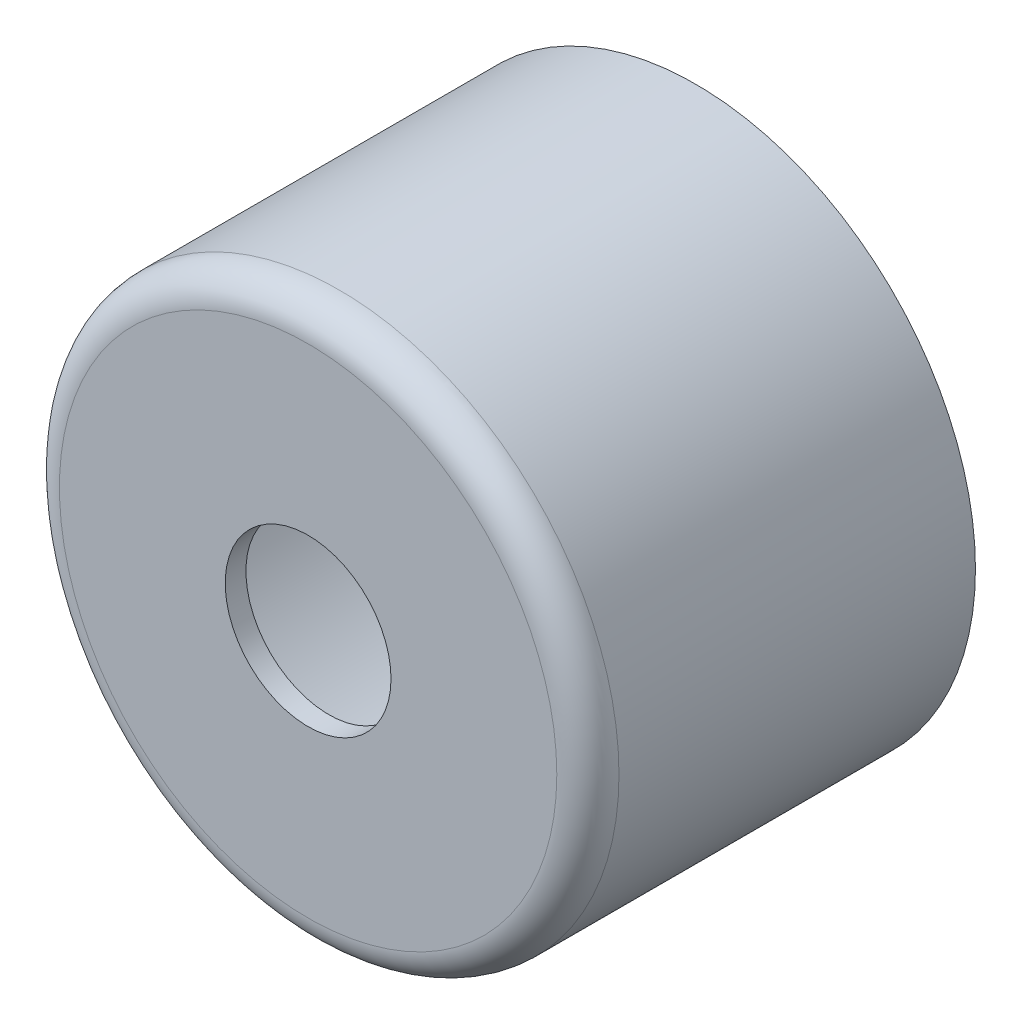
ISO-10303-21;
HEADER;
FILE_DESCRIPTION(('STEP AP214'),'2;1');
FILE_NAME('part.step','',(''),(''),'','','');
FILE_SCHEMA(('AUTOMOTIVE_DESIGN { 1 0 10303 214 1 1 1 1 }'));
ENDSEC;
DATA;
#1=APPLICATION_CONTEXT('core data for automotive mechanical design processes');
#2=APPLICATION_PROTOCOL_DEFINITION('international standard','automotive_design',2000,#1);
#3=PRODUCT_CONTEXT('',#1,'mechanical');
#4=PRODUCT('Part','Part','',(#3));
#5=PRODUCT_RELATED_PRODUCT_CATEGORY('part','',(#4));
#6=PRODUCT_DEFINITION_FORMATION('','',#4);
#7=PRODUCT_DEFINITION_CONTEXT('part definition',#1,'design');
#8=PRODUCT_DEFINITION('design','',#6,#7);
#9=PRODUCT_DEFINITION_SHAPE('','',#8);
#10=(LENGTH_UNIT() NAMED_UNIT(*) SI_UNIT(.MILLI.,.METRE.));
#11=(NAMED_UNIT(*) PLANE_ANGLE_UNIT() SI_UNIT($,.RADIAN.));
#12=(NAMED_UNIT(*) SI_UNIT($,.STERADIAN.) SOLID_ANGLE_UNIT());
#13=UNCERTAINTY_MEASURE_WITH_UNIT(LENGTH_MEASURE(1.E-05),#10,'distance_accuracy_value','');
#14=(GEOMETRIC_REPRESENTATION_CONTEXT(3) GLOBAL_UNCERTAINTY_ASSIGNED_CONTEXT((#13)) GLOBAL_UNIT_ASSIGNED_CONTEXT((#10,
#11,#12)) REPRESENTATION_CONTEXT('',''));
#15=CARTESIAN_POINT('',(0.,0.,0.));
#16=DIRECTION('',(0.,0.,1.));
#17=DIRECTION('',(1.,0.,0.));
#18=AXIS2_PLACEMENT_3D('',#15,#16,#17);
#19=CARTESIAN_POINT('',(0.,0.,18.7));
#20=DIRECTION('',(0.,0.,-1.));
#21=DIRECTION('',(-1.,0.,0.));
#22=AXIS2_PLACEMENT_3D('',#19,#20,#21);
#23=CYLINDRICAL_SURFACE('',#22,13.5);
#24=CARTESIAN_POINT('',(0.,0.,17.2));
#25=DIRECTION('',(0.,0.,1.));
#26=DIRECTION('',(1.,0.,0.));
#27=AXIS2_PLACEMENT_3D('',#24,#25,#26);
#28=CIRCLE('',#27,13.5);
#29=CARTESIAN_POINT('',(13.5,0.,17.2));
#30=VERTEX_POINT('',#29);
#31=EDGE_CURVE('E10',#30,#30,#28,.F.);
#32=ORIENTED_EDGE('',*,*,#31,.T.);
#33=EDGE_LOOP('',(#32));
#34=FACE_BOUND('',#33,.T.);
#35=CARTESIAN_POINT('',(0.,0.,0.));
#36=DIRECTION('',(0.,0.,1.));
#37=DIRECTION('',(1.,0.,0.));
#38=AXIS2_PLACEMENT_3D('',#35,#36,#37);
#39=CIRCLE('',#38,13.5);
#40=CARTESIAN_POINT('',(13.5,0.,0.));
#41=VERTEX_POINT('',#40);
#42=EDGE_CURVE('E43',#41,#41,#39,.T.);
#43=ORIENTED_EDGE('',*,*,#42,.T.);
#44=EDGE_LOOP('',(#43));
#45=FACE_BOUND('',#44,.T.);
#46=ADVANCED_FACE('F32',(#34,#45),#23,.T.);
#47=CARTESIAN_POINT('',(0.,0.,18.7));
#48=DIRECTION('',(0.,0.,1.));
#49=DIRECTION('',(1.,0.,0.));
#50=AXIS2_PLACEMENT_3D('',#47,#48,#49);
#51=PLANE('',#50);
#52=CARTESIAN_POINT('',(0.,0.,18.7));
#53=DIRECTION('',(0.,0.,1.));
#54=DIRECTION('',(1.,0.,0.));
#55=AXIS2_PLACEMENT_3D('',#52,#53,#54);
#56=CIRCLE('',#55,4.);
#57=CARTESIAN_POINT('',(4.,0.,18.7));
#58=VERTEX_POINT('',#57);
#59=EDGE_CURVE('E57',#58,#58,#56,.T.);
#60=ORIENTED_EDGE('',*,*,#59,.F.);
#61=EDGE_LOOP('',(#60));
#62=FACE_BOUND('',#61,.T.);
#63=CARTESIAN_POINT('',(0.,0.,18.7));
#64=DIRECTION('',(0.,0.,1.));
#65=DIRECTION('',(1.,0.,0.));
#66=AXIS2_PLACEMENT_3D('',#63,#64,#65);
#67=CIRCLE('',#66,12.);
#68=CARTESIAN_POINT('',(12.,0.,18.7));
#69=VERTEX_POINT('',#68);
#70=EDGE_CURVE('E39',#69,#69,#67,.T.);
#71=ORIENTED_EDGE('',*,*,#70,.T.);
#72=EDGE_LOOP('',(#71));
#73=FACE_BOUND('',#72,.T.);
#74=ADVANCED_FACE('F78',(#62,#73),#51,.T.);
#75=CARTESIAN_POINT('',(0.,0.,0.));
#76=DIRECTION('',(0.,0.,1.));
#77=DIRECTION('',(1.,0.,0.));
#78=AXIS2_PLACEMENT_3D('',#75,#76,#77);
#79=PLANE('',#78);
#80=CARTESIAN_POINT('',(0.,0.,0.));
#81=DIRECTION('',(0.,0.,1.));
#82=DIRECTION('',(1.,0.,0.));
#83=AXIS2_PLACEMENT_3D('',#80,#81,#82);
#84=CIRCLE('',#83,12.5);
#85=CARTESIAN_POINT('',(12.5,0.,0.));
#86=VERTEX_POINT('',#85);
#87=EDGE_CURVE('E49',#86,#86,#84,.T.);
#88=ORIENTED_EDGE('',*,*,#87,.T.);
#89=EDGE_LOOP('',(#88));
#90=FACE_BOUND('',#89,.T.);
#91=ORIENTED_EDGE('',*,*,#42,.F.);
#92=EDGE_LOOP('',(#91));
#93=FACE_BOUND('',#92,.T.);
#94=ADVANCED_FACE('F82',(#90,#93),#79,.F.);
#95=CARTESIAN_POINT('',(0.,0.,17.2));
#96=DIRECTION('',(0.,0.,1.));
#97=DIRECTION('',(1.,0.,0.));
#98=AXIS2_PLACEMENT_3D('',#95,#96,#97);
#99=TOROIDAL_SURFACE('',#98,12.,1.5);
#100=ORIENTED_EDGE('',*,*,#31,.F.);
#101=EDGE_LOOP('',(#100));
#102=FACE_BOUND('',#101,.T.);
#103=ORIENTED_EDGE('',*,*,#70,.F.);
#104=EDGE_LOOP('',(#103));
#105=FACE_BOUND('',#104,.T.);
#106=ADVANCED_FACE('F88',(#102,#105),#99,.T.);
#107=CARTESIAN_POINT('',(0.,0.,18.7));
#108=DIRECTION('',(0.,0.,-1.));
#109=DIRECTION('',(-1.,0.,0.));
#110=AXIS2_PLACEMENT_3D('',#107,#108,#109);
#111=CYLINDRICAL_SURFACE('',#110,12.5);
#112=CARTESIAN_POINT('',(0.,0.,17.2));
#113=DIRECTION('',(0.,0.,-1.));
#114=DIRECTION('',(-1.,0.,0.));
#115=AXIS2_PLACEMENT_3D('',#112,#113,#114);
#116=CIRCLE('',#115,12.5);
#117=CARTESIAN_POINT('',(-12.5,0.,17.2));
#118=VERTEX_POINT('',#117);
#119=EDGE_CURVE('E48',#118,#118,#116,.T.);
#120=ORIENTED_EDGE('',*,*,#119,.F.);
#121=EDGE_LOOP('',(#120));
#122=FACE_BOUND('',#121,.T.);
#123=ORIENTED_EDGE('',*,*,#87,.F.);
#124=EDGE_LOOP('',(#123));
#125=FACE_BOUND('',#124,.T.);
#126=ADVANCED_FACE('F94',(#122,#125),#111,.F.);
#127=CARTESIAN_POINT('',(0.,0.,17.7));
#128=DIRECTION('',(0.,0.,1.));
#129=DIRECTION('',(1.,0.,0.));
#130=AXIS2_PLACEMENT_3D('',#127,#128,#129);
#131=PLANE('',#130);
#132=CARTESIAN_POINT('',(0.,0.,17.7));
#133=DIRECTION('',(0.,0.,1.));
#134=DIRECTION('',(1.,0.,0.));
#135=AXIS2_PLACEMENT_3D('',#132,#133,#134);
#136=CIRCLE('',#135,4.);
#137=CARTESIAN_POINT('',(4.,0.,17.7));
#138=VERTEX_POINT('',#137);
#139=EDGE_CURVE('E35',#138,#138,#136,.T.);
#140=ORIENTED_EDGE('',*,*,#139,.T.);
#141=EDGE_LOOP('',(#140));
#142=FACE_BOUND('',#141,.T.);
#143=CARTESIAN_POINT('',(0.,0.,17.7));
#144=DIRECTION('',(0.,0.,1.));
#145=DIRECTION('',(1.,0.,0.));
#146=AXIS2_PLACEMENT_3D('',#143,#144,#145);
#147=CIRCLE('',#146,12.);
#148=CARTESIAN_POINT('',(12.,0.,17.7));
#149=VERTEX_POINT('',#148);
#150=EDGE_CURVE('E52',#149,#149,#147,.T.);
#151=ORIENTED_EDGE('',*,*,#150,.F.);
#152=EDGE_LOOP('',(#151));
#153=FACE_BOUND('',#152,.T.);
#154=ADVANCED_FACE('F64',(#142,#153),#131,.F.);
#155=CARTESIAN_POINT('',(0.,0.,17.2));
#156=DIRECTION('',(0.,0.,1.));
#157=DIRECTION('',(1.,0.,0.));
#158=AXIS2_PLACEMENT_3D('',#155,#156,#157);
#159=TOROIDAL_SURFACE('',#158,12.,0.5);
#160=ORIENTED_EDGE('',*,*,#119,.T.);
#161=EDGE_LOOP('',(#160));
#162=FACE_BOUND('',#161,.T.);
#163=ORIENTED_EDGE('',*,*,#150,.T.);
#164=EDGE_LOOP('',(#163));
#165=FACE_BOUND('',#164,.T.);
#166=ADVANCED_FACE('F69',(#162,#165),#159,.F.);
#167=CARTESIAN_POINT('',(0.,0.,0.));
#168=DIRECTION('',(0.,0.,1.));
#169=DIRECTION('',(1.,0.,0.));
#170=AXIS2_PLACEMENT_3D('',#167,#168,#169);
#171=CYLINDRICAL_SURFACE('',#170,4.);
#172=ORIENTED_EDGE('',*,*,#59,.T.);
#173=EDGE_LOOP('',(#172));
#174=FACE_BOUND('',#173,.T.);
#175=ORIENTED_EDGE('',*,*,#139,.F.);
#176=EDGE_LOOP('',(#175));
#177=FACE_BOUND('',#176,.T.);
#178=ADVANCED_FACE('F67',(#174,#177),#171,.F.);
#179=CLOSED_SHELL('',(#46,#74,#94,#106,#126,#154,#166,#178));
#180=MANIFOLD_SOLID_BREP('B2',#179);
#181=ADVANCED_BREP_SHAPE_REPRESENTATION('',(#18,#180),#14);
#182=SHAPE_DEFINITION_REPRESENTATION(#9,#181);
ENDSEC;
END-ISO-10303-21;
